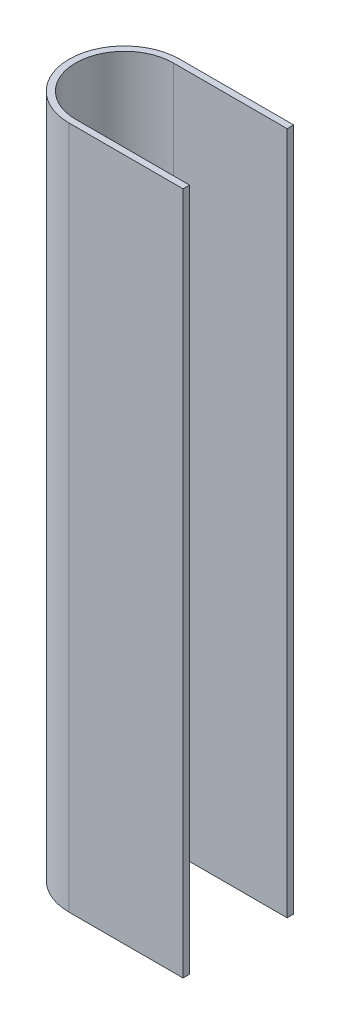
ISO-10303-21;
HEADER;
FILE_DESCRIPTION(('STEP AP214'),'2;1');
FILE_NAME('part.step','',(''),(''),'','','');
FILE_SCHEMA(('AUTOMOTIVE_DESIGN { 1 0 10303 214 1 1 1 1 }'));
ENDSEC;
DATA;
#1=APPLICATION_CONTEXT('core data for automotive mechanical design processes');
#2=APPLICATION_PROTOCOL_DEFINITION('international standard','automotive_design',2000,#1);
#3=PRODUCT_CONTEXT('',#1,'mechanical');
#4=PRODUCT('Part','Part','',(#3));
#5=PRODUCT_RELATED_PRODUCT_CATEGORY('part','',(#4));
#6=PRODUCT_DEFINITION_FORMATION('','',#4);
#7=PRODUCT_DEFINITION_CONTEXT('part definition',#1,'design');
#8=PRODUCT_DEFINITION('design','',#6,#7);
#9=PRODUCT_DEFINITION_SHAPE('','',#8);
#10=(LENGTH_UNIT() NAMED_UNIT(*) SI_UNIT(.MILLI.,.METRE.));
#11=(NAMED_UNIT(*) PLANE_ANGLE_UNIT() SI_UNIT($,.RADIAN.));
#12=(NAMED_UNIT(*) SI_UNIT($,.STERADIAN.) SOLID_ANGLE_UNIT());
#13=UNCERTAINTY_MEASURE_WITH_UNIT(LENGTH_MEASURE(1.E-05),#10,'distance_accuracy_value','');
#14=(GEOMETRIC_REPRESENTATION_CONTEXT(3) GLOBAL_UNCERTAINTY_ASSIGNED_CONTEXT((#13)) GLOBAL_UNIT_ASSIGNED_CONTEXT((#10,
#11,#12)) REPRESENTATION_CONTEXT('',''));
#15=CARTESIAN_POINT('',(0.,0.,0.));
#16=DIRECTION('',(0.,0.,1.));
#17=DIRECTION('',(1.,0.,0.));
#18=AXIS2_PLACEMENT_3D('',#15,#16,#17);
#19=CARTESIAN_POINT('',(-24.5,-10.5,2.5));
#20=DIRECTION('',(1.,0.,0.));
#21=DIRECTION('',(0.,0.,-1.));
#22=AXIS2_PLACEMENT_3D('',#19,#20,#21);
#23=PLANE('',#22);
#24=DIRECTION('',(0.,-1.,0.));
#25=VECTOR('',#24,1.);
#26=CARTESIAN_POINT('',(-24.5,-10.5,2.7));
#27=LINE('',#26,#25);
#28=CARTESIAN_POINT('',(-24.5,-10.5,2.7));
#29=VERTEX_POINT('',#28);
#30=CARTESIAN_POINT('',(-24.5,10.5,2.7));
#31=VERTEX_POINT('',#30);
#32=EDGE_CURVE('E122',#29,#31,#27,.F.);
#33=ORIENTED_EDGE('',*,*,#32,.F.);
#34=DIRECTION('',(0.,0.,1.));
#35=VECTOR('',#34,1.);
#36=CARTESIAN_POINT('',(-24.5,-10.5,1.));
#37=LINE('',#36,#35);
#38=CARTESIAN_POINT('',(-24.5,-10.5,2.5));
#39=VERTEX_POINT('',#38);
#40=EDGE_CURVE('E73',#29,#39,#37,.F.);
#41=ORIENTED_EDGE('',*,*,#40,.T.);
#42=DIRECTION('',(0.,1.,0.));
#43=VECTOR('',#42,1.);
#44=CARTESIAN_POINT('',(-24.5,-10.5,2.5));
#45=LINE('',#44,#43);
#46=CARTESIAN_POINT('',(-24.5,10.5,2.5));
#47=VERTEX_POINT('',#46);
#48=EDGE_CURVE('E90',#47,#39,#45,.F.);
#49=ORIENTED_EDGE('',*,*,#48,.F.);
#50=DIRECTION('',(0.,0.,-1.));
#51=VECTOR('',#50,1.);
#52=CARTESIAN_POINT('',(-24.5,10.5,2.5));
#53=LINE('',#52,#51);
#54=EDGE_CURVE('E83',#47,#31,#53,.F.);
#55=ORIENTED_EDGE('',*,*,#54,.T.);
#56=EDGE_LOOP('',(#33,#41,#49,#55));
#57=FACE_BOUND('',#56,.T.);
#58=ADVANCED_FACE('F17',(#57),#23,.T.);
#59=CARTESIAN_POINT('',(-28.,-10.5,-0.5));
#60=DIRECTION('',(0.,0.,-1.));
#61=DIRECTION('',(0.,1.,0.));
#62=AXIS2_PLACEMENT_3D('',#59,#60,#61);
#63=PLANE('',#62);
#64=DIRECTION('',(0.,1.,0.));
#65=VECTOR('',#64,1.);
#66=CARTESIAN_POINT('',(-24.5,-10.5,-0.5));
#67=LINE('',#66,#65);
#68=CARTESIAN_POINT('',(-24.5,-10.5,-0.5));
#69=VERTEX_POINT('',#68);
#70=CARTESIAN_POINT('',(-24.5,10.5,-0.5));
#71=VERTEX_POINT('',#70);
#72=EDGE_CURVE('E131',#69,#71,#67,.T.);
#73=ORIENTED_EDGE('',*,*,#72,.T.);
#74=DIRECTION('',(1.,0.,0.));
#75=VECTOR('',#74,1.);
#76=CARTESIAN_POINT('',(-27.29178088128,10.5,-0.5));
#77=LINE('',#76,#75);
#78=CARTESIAN_POINT('',(-28.,10.5,-0.499999999999993));
#79=VERTEX_POINT('',#78);
#80=EDGE_CURVE('E106',#79,#71,#77,.T.);
#81=ORIENTED_EDGE('',*,*,#80,.F.);
#82=DIRECTION('',(0.,-1.,0.));
#83=VECTOR('',#82,1.);
#84=CARTESIAN_POINT('',(-28.,-10.5,-0.5));
#85=LINE('',#84,#83);
#86=CARTESIAN_POINT('',(-28.,-10.5,-0.5));
#87=VERTEX_POINT('',#86);
#88=EDGE_CURVE('E150',#79,#87,#85,.T.);
#89=ORIENTED_EDGE('',*,*,#88,.T.);
#90=DIRECTION('',(1.,0.,0.));
#91=VECTOR('',#90,1.);
#92=CARTESIAN_POINT('',(-27.29178088128,-10.5,-0.5));
#93=LINE('',#92,#91);
#94=EDGE_CURVE('E128',#87,#69,#93,.T.);
#95=ORIENTED_EDGE('',*,*,#94,.T.);
#96=EDGE_LOOP('',(#73,#81,#89,#95));
#97=FACE_BOUND('',#96,.T.);
#98=ADVANCED_FACE('F188',(#97),#63,.F.);
#99=CARTESIAN_POINT('',(-28.,-10.5,2.5));
#100=DIRECTION('',(0.,0.,-1.));
#101=DIRECTION('',(0.,1.,0.));
#102=AXIS2_PLACEMENT_3D('',#99,#100,#101);
#103=PLANE('',#102);
#104=ORIENTED_EDGE('',*,*,#48,.T.);
#105=DIRECTION('',(1.,0.,0.));
#106=VECTOR('',#105,1.);
#107=CARTESIAN_POINT('',(-27.29178088128,-10.5,2.5));
#108=LINE('',#107,#106);
#109=CARTESIAN_POINT('',(-28.,-10.5,2.5));
#110=VERTEX_POINT('',#109);
#111=EDGE_CURVE('E63',#39,#110,#108,.F.);
#112=ORIENTED_EDGE('',*,*,#111,.T.);
#113=DIRECTION('',(0.,-1.,0.));
#114=VECTOR('',#113,1.);
#115=CARTESIAN_POINT('',(-28.,-10.5,2.5));
#116=LINE('',#115,#114);
#117=CARTESIAN_POINT('',(-28.,10.5,2.50000000000001));
#118=VERTEX_POINT('',#117);
#119=EDGE_CURVE('E92',#110,#118,#116,.F.);
#120=ORIENTED_EDGE('',*,*,#119,.T.);
#121=DIRECTION('',(1.,0.,0.));
#122=VECTOR('',#121,1.);
#123=CARTESIAN_POINT('',(-27.29178088128,10.5,2.5));
#124=LINE('',#123,#122);
#125=EDGE_CURVE('E87',#47,#118,#124,.F.);
#126=ORIENTED_EDGE('',*,*,#125,.F.);
#127=EDGE_LOOP('',(#104,#112,#120,#126));
#128=FACE_BOUND('',#127,.T.);
#129=ADVANCED_FACE('F94',(#128),#103,.T.);
#130=CARTESIAN_POINT('',(-28.,-10.5,1.));
#131=DIRECTION('',(0.,-1.,0.));
#132=DIRECTION('',(0.,0.,-1.));
#133=AXIS2_PLACEMENT_3D('',#130,#131,#132);
#134=CYLINDRICAL_SURFACE('',#133,1.5);
#135=CARTESIAN_POINT('',(-28.,10.5,1.00000000000001));
#136=DIRECTION('',(0.,-1.,0.));
#137=DIRECTION('',(0.,0.,-1.));
#138=AXIS2_PLACEMENT_3D('',#135,#136,#137);
#139=CIRCLE('',#138,1.5);
#140=EDGE_CURVE('E96',#118,#79,#139,.T.);
#141=ORIENTED_EDGE('',*,*,#140,.F.);
#142=ORIENTED_EDGE('',*,*,#119,.F.);
#143=CARTESIAN_POINT('',(-28.,-10.5,1.));
#144=DIRECTION('',(0.,-1.,0.));
#145=DIRECTION('',(0.,0.,-1.));
#146=AXIS2_PLACEMENT_3D('',#143,#144,#145);
#147=CIRCLE('',#146,1.5);
#148=EDGE_CURVE('E20',#110,#87,#147,.T.);
#149=ORIENTED_EDGE('',*,*,#148,.T.);
#150=ORIENTED_EDGE('',*,*,#88,.F.);
#151=EDGE_LOOP('',(#141,#142,#149,#150));
#152=FACE_BOUND('',#151,.T.);
#153=ADVANCED_FACE('F191',(#152),#134,.F.);
#154=CARTESIAN_POINT('',(-24.5,-10.5,-0.5));
#155=DIRECTION('',(-1.,0.,0.));
#156=DIRECTION('',(0.,0.,1.));
#157=AXIS2_PLACEMENT_3D('',#154,#155,#156);
#158=PLANE('',#157);
#159=DIRECTION('',(0.,-1.,0.));
#160=VECTOR('',#159,1.);
#161=CARTESIAN_POINT('',(-24.5,-10.5,-0.7));
#162=LINE('',#161,#160);
#163=CARTESIAN_POINT('',(-24.5,-10.5,-0.7));
#164=VERTEX_POINT('',#163);
#165=CARTESIAN_POINT('',(-24.5,10.5,-0.699999999999986));
#166=VERTEX_POINT('',#165);
#167=EDGE_CURVE('E98',#164,#166,#162,.F.);
#168=ORIENTED_EDGE('',*,*,#167,.T.);
#169=DIRECTION('',(0.,0.,1.));
#170=VECTOR('',#169,1.);
#171=CARTESIAN_POINT('',(-24.5,10.5,1.));
#172=LINE('',#171,#170);
#173=EDGE_CURVE('E99',#71,#166,#172,.F.);
#174=ORIENTED_EDGE('',*,*,#173,.F.);
#175=ORIENTED_EDGE('',*,*,#72,.F.);
#176=DIRECTION('',(0.,0.,1.));
#177=VECTOR('',#176,1.);
#178=CARTESIAN_POINT('',(-24.5,-10.5,1.));
#179=LINE('',#178,#177);
#180=EDGE_CURVE('E130',#69,#164,#179,.F.);
#181=ORIENTED_EDGE('',*,*,#180,.T.);
#182=EDGE_LOOP('',(#168,#174,#175,#181));
#183=FACE_BOUND('',#182,.T.);
#184=ADVANCED_FACE('F183',(#183),#158,.F.);
#185=CARTESIAN_POINT('',(-27.29178088128,-10.5,1.));
#186=DIRECTION('',(0.,1.,0.));
#187=DIRECTION('',(0.,0.,1.));
#188=AXIS2_PLACEMENT_3D('',#185,#186,#187);
#189=PLANE('',#188);
#190=ORIENTED_EDGE('',*,*,#111,.F.);
#191=ORIENTED_EDGE('',*,*,#40,.F.);
#192=DIRECTION('',(1.,0.,0.));
#193=VECTOR('',#192,1.);
#194=CARTESIAN_POINT('',(-24.5,-10.5,2.7));
#195=LINE('',#194,#193);
#196=CARTESIAN_POINT('',(-28.,-10.5,2.7));
#197=VERTEX_POINT('',#196);
#198=EDGE_CURVE('E109',#197,#29,#195,.T.);
#199=ORIENTED_EDGE('',*,*,#198,.F.);
#200=CARTESIAN_POINT('',(-28.,-10.5,1.));
#201=DIRECTION('',(0.,-1.,0.));
#202=DIRECTION('',(0.,0.,-1.));
#203=AXIS2_PLACEMENT_3D('',#200,#201,#202);
#204=CIRCLE('',#203,1.7);
#205=CARTESIAN_POINT('',(-28.,-10.5,-0.7));
#206=VERTEX_POINT('',#205);
#207=EDGE_CURVE('E114',#206,#197,#204,.F.);
#208=ORIENTED_EDGE('',*,*,#207,.F.);
#209=DIRECTION('',(1.,0.,0.));
#210=VECTOR('',#209,1.);
#211=CARTESIAN_POINT('',(-24.5,-10.5,-0.7));
#212=LINE('',#211,#210);
#213=EDGE_CURVE('E117',#206,#164,#212,.T.);
#214=ORIENTED_EDGE('',*,*,#213,.T.);
#215=ORIENTED_EDGE('',*,*,#180,.F.);
#216=ORIENTED_EDGE('',*,*,#94,.F.);
#217=ORIENTED_EDGE('',*,*,#148,.F.);
#218=EDGE_LOOP('',(#190,#191,#199,#208,#214,#215,#216,#217));
#219=FACE_BOUND('',#218,.T.);
#220=ADVANCED_FACE('F175',(#219),#189,.F.);
#221=CARTESIAN_POINT('',(-24.5,-10.5,2.7));
#222=DIRECTION('',(0.,0.,1.));
#223=DIRECTION('',(0.,-1.,0.));
#224=AXIS2_PLACEMENT_3D('',#221,#222,#223);
#225=PLANE('',#224);
#226=DIRECTION('',(0.,-1.,0.));
#227=VECTOR('',#226,1.);
#228=CARTESIAN_POINT('',(-28.,-10.5,2.7));
#229=LINE('',#228,#227);
#230=CARTESIAN_POINT('',(-28.,10.5,2.70000000000001));
#231=VERTEX_POINT('',#230);
#232=EDGE_CURVE('E112',#197,#231,#229,.F.);
#233=ORIENTED_EDGE('',*,*,#232,.F.);
#234=ORIENTED_EDGE('',*,*,#198,.T.);
#235=ORIENTED_EDGE('',*,*,#32,.T.);
#236=DIRECTION('',(1.,0.,0.));
#237=VECTOR('',#236,1.);
#238=CARTESIAN_POINT('',(-27.29178088128,10.5,2.7));
#239=LINE('',#238,#237);
#240=EDGE_CURVE('E88',#231,#31,#239,.T.);
#241=ORIENTED_EDGE('',*,*,#240,.F.);
#242=EDGE_LOOP('',(#233,#234,#235,#241));
#243=FACE_BOUND('',#242,.T.);
#244=ADVANCED_FACE('F195',(#243),#225,.T.);
#245=CARTESIAN_POINT('',(-27.29178088128,10.5,1.));
#246=DIRECTION('',(0.,1.,0.));
#247=DIRECTION('',(0.,0.,1.));
#248=AXIS2_PLACEMENT_3D('',#245,#246,#247);
#249=PLANE('',#248);
#250=ORIENTED_EDGE('',*,*,#125,.T.);
#251=ORIENTED_EDGE('',*,*,#140,.T.);
#252=ORIENTED_EDGE('',*,*,#80,.T.);
#253=ORIENTED_EDGE('',*,*,#173,.T.);
#254=DIRECTION('',(1.,0.,0.));
#255=VECTOR('',#254,1.);
#256=CARTESIAN_POINT('',(-24.5,10.5,-0.699999999999986));
#257=LINE('',#256,#255);
#258=CARTESIAN_POINT('',(-28.,10.5,-0.699999999999986));
#259=VERTEX_POINT('',#258);
#260=EDGE_CURVE('E35',#166,#259,#257,.F.);
#261=ORIENTED_EDGE('',*,*,#260,.T.);
#262=CARTESIAN_POINT('',(-28.,10.5,1.00000000000001));
#263=DIRECTION('',(0.,-1.,0.));
#264=DIRECTION('',(0.,0.,-1.));
#265=AXIS2_PLACEMENT_3D('',#262,#263,#264);
#266=CIRCLE('',#265,1.7);
#267=EDGE_CURVE('E26',#231,#259,#266,.T.);
#268=ORIENTED_EDGE('',*,*,#267,.F.);
#269=ORIENTED_EDGE('',*,*,#240,.T.);
#270=ORIENTED_EDGE('',*,*,#54,.F.);
#271=EDGE_LOOP('',(#250,#251,#252,#253,#261,#268,#269,#270));
#272=FACE_BOUND('',#271,.T.);
#273=ADVANCED_FACE('F84',(#272),#249,.T.);
#274=CARTESIAN_POINT('',(-24.5,-10.5,-0.7));
#275=DIRECTION('',(0.,0.,1.));
#276=DIRECTION('',(0.,-1.,0.));
#277=AXIS2_PLACEMENT_3D('',#274,#275,#276);
#278=PLANE('',#277);
#279=DIRECTION('',(0.,-1.,0.));
#280=VECTOR('',#279,1.);
#281=CARTESIAN_POINT('',(-28.,-10.5,-0.7));
#282=LINE('',#281,#280);
#283=EDGE_CURVE('E11',#259,#206,#282,.T.);
#284=ORIENTED_EDGE('',*,*,#283,.F.);
#285=ORIENTED_EDGE('',*,*,#260,.F.);
#286=ORIENTED_EDGE('',*,*,#167,.F.);
#287=ORIENTED_EDGE('',*,*,#213,.F.);
#288=EDGE_LOOP('',(#284,#285,#286,#287));
#289=FACE_BOUND('',#288,.T.);
#290=ADVANCED_FACE('F179',(#289),#278,.F.);
#291=CARTESIAN_POINT('',(-28.,-10.5,1.));
#292=DIRECTION('',(0.,-1.,0.));
#293=DIRECTION('',(0.,0.,-1.));
#294=AXIS2_PLACEMENT_3D('',#291,#292,#293);
#295=CYLINDRICAL_SURFACE('',#294,1.7);
#296=ORIENTED_EDGE('',*,*,#267,.T.);
#297=ORIENTED_EDGE('',*,*,#283,.T.);
#298=ORIENTED_EDGE('',*,*,#207,.T.);
#299=ORIENTED_EDGE('',*,*,#232,.T.);
#300=EDGE_LOOP('',(#296,#297,#298,#299));
#301=FACE_BOUND('',#300,.T.);
#302=ADVANCED_FACE('F171',(#301),#295,.T.);
#303=CLOSED_SHELL('',(#58,#98,#129,#153,#184,#220,#244,#273,#290,#302));
#304=MANIFOLD_SOLID_BREP('B1',#303);
#305=ADVANCED_BREP_SHAPE_REPRESENTATION('',(#18,#304),#14);
#306=SHAPE_DEFINITION_REPRESENTATION(#9,#305);
ENDSEC;
END-ISO-10303-21;
